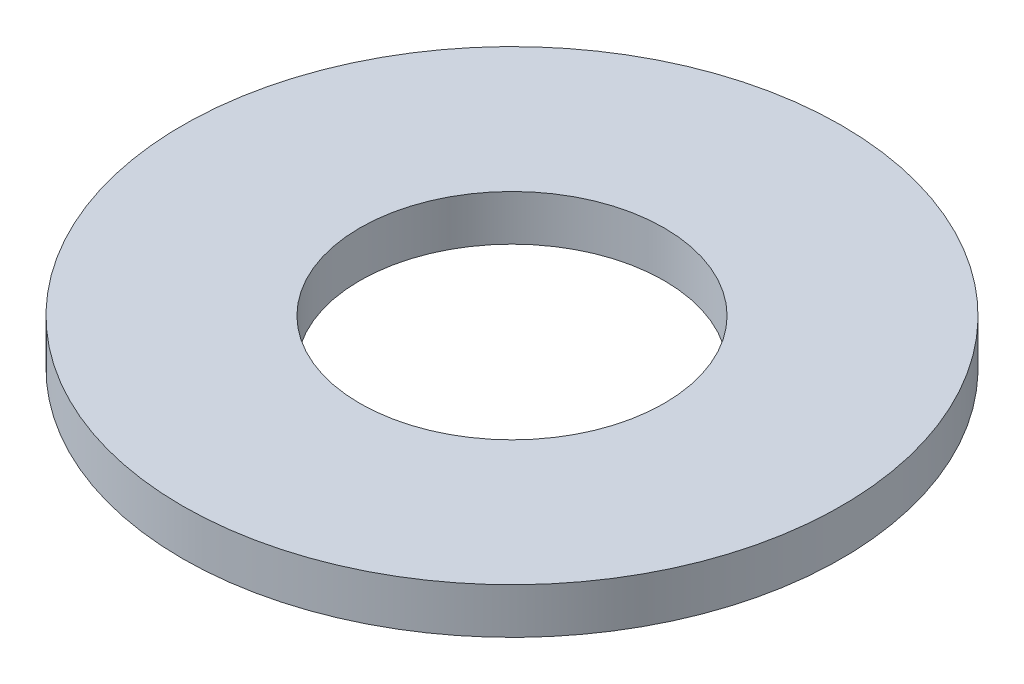
ISO-10303-21;
HEADER;
FILE_DESCRIPTION(('STEP AP214'),'2;1');
FILE_NAME('part.step','',(''),(''),'','','');
FILE_SCHEMA(('AUTOMOTIVE_DESIGN { 1 0 10303 214 1 1 1 1 }'));
ENDSEC;
DATA;
#1=APPLICATION_CONTEXT('core data for automotive mechanical design processes');
#2=APPLICATION_PROTOCOL_DEFINITION('international standard','automotive_design',2000,#1);
#3=PRODUCT_CONTEXT('',#1,'mechanical');
#4=PRODUCT('Part','Part','',(#3));
#5=PRODUCT_RELATED_PRODUCT_CATEGORY('part','',(#4));
#6=PRODUCT_DEFINITION_FORMATION('','',#4);
#7=PRODUCT_DEFINITION_CONTEXT('part definition',#1,'design');
#8=PRODUCT_DEFINITION('design','',#6,#7);
#9=PRODUCT_DEFINITION_SHAPE('','',#8);
#10=(LENGTH_UNIT() NAMED_UNIT(*) SI_UNIT(.MILLI.,.METRE.));
#11=(NAMED_UNIT(*) PLANE_ANGLE_UNIT() SI_UNIT($,.RADIAN.));
#12=(NAMED_UNIT(*) SI_UNIT($,.STERADIAN.) SOLID_ANGLE_UNIT());
#13=UNCERTAINTY_MEASURE_WITH_UNIT(LENGTH_MEASURE(1.E-05),#10,'distance_accuracy_value','');
#14=(GEOMETRIC_REPRESENTATION_CONTEXT(3) GLOBAL_UNCERTAINTY_ASSIGNED_CONTEXT((#13)) GLOBAL_UNIT_ASSIGNED_CONTEXT((#10,
#11,#12)) REPRESENTATION_CONTEXT('',''));
#15=CARTESIAN_POINT('',(0.,0.,0.));
#16=DIRECTION('',(0.,0.,1.));
#17=DIRECTION('',(1.,0.,0.));
#18=AXIS2_PLACEMENT_3D('',#15,#16,#17);
#19=CARTESIAN_POINT('',(0.,9.,0.));
#20=DIRECTION('',(0.,-1.,0.));
#21=DIRECTION('',(0.,0.,-1.));
#22=AXIS2_PLACEMENT_3D('',#19,#20,#21);
#23=CYLINDRICAL_SURFACE('',#22,65.);
#24=CARTESIAN_POINT('',(0.,9.,0.));
#25=DIRECTION('',(0.,1.,0.));
#26=DIRECTION('',(0.,0.,1.));
#27=AXIS2_PLACEMENT_3D('',#24,#25,#26);
#28=CIRCLE('',#27,65.);
#29=CARTESIAN_POINT('',(0.,9.,65.));
#30=VERTEX_POINT('',#29);
#31=EDGE_CURVE('E10',#30,#30,#28,.T.);
#32=ORIENTED_EDGE('',*,*,#31,.F.);
#33=EDGE_LOOP('',(#32));
#34=FACE_BOUND('',#33,.T.);
#35=CARTESIAN_POINT('',(0.,0.,0.));
#36=DIRECTION('',(0.,1.,0.));
#37=DIRECTION('',(0.,0.,1.));
#38=AXIS2_PLACEMENT_3D('',#35,#36,#37);
#39=CIRCLE('',#38,65.);
#40=CARTESIAN_POINT('',(0.,0.,65.));
#41=VERTEX_POINT('',#40);
#42=EDGE_CURVE('E37',#41,#41,#39,.T.);
#43=ORIENTED_EDGE('',*,*,#42,.T.);
#44=EDGE_LOOP('',(#43));
#45=FACE_BOUND('',#44,.T.);
#46=ADVANCED_FACE('F40',(#34,#45),#23,.T.);
#47=CARTESIAN_POINT('',(0.,9.,0.));
#48=DIRECTION('',(0.,1.,0.));
#49=DIRECTION('',(0.,0.,1.));
#50=AXIS2_PLACEMENT_3D('',#47,#48,#49);
#51=PLANE('',#50);
#52=CARTESIAN_POINT('',(0.,9.,0.));
#53=DIRECTION('',(0.,1.,0.));
#54=DIRECTION('',(0.,0.,1.));
#55=AXIS2_PLACEMENT_3D('',#52,#53,#54);
#56=CIRCLE('',#55,30.);
#57=CARTESIAN_POINT('',(0.,9.,30.));
#58=VERTEX_POINT('',#57);
#59=EDGE_CURVE('E50',#58,#58,#56,.T.);
#60=ORIENTED_EDGE('',*,*,#59,.F.);
#61=EDGE_LOOP('',(#60));
#62=FACE_BOUND('',#61,.T.);
#63=ORIENTED_EDGE('',*,*,#31,.T.);
#64=EDGE_LOOP('',(#63));
#65=FACE_BOUND('',#64,.T.);
#66=ADVANCED_FACE('F59',(#62,#65),#51,.T.);
#67=CARTESIAN_POINT('',(0.,0.,0.));
#68=DIRECTION('',(0.,1.,0.));
#69=DIRECTION('',(0.,0.,1.));
#70=AXIS2_PLACEMENT_3D('',#67,#68,#69);
#71=PLANE('',#70);
#72=CARTESIAN_POINT('',(0.,0.,0.));
#73=DIRECTION('',(0.,1.,0.));
#74=DIRECTION('',(0.,0.,1.));
#75=AXIS2_PLACEMENT_3D('',#72,#73,#74);
#76=CIRCLE('',#75,30.);
#77=CARTESIAN_POINT('',(0.,0.,30.));
#78=VERTEX_POINT('',#77);
#79=EDGE_CURVE('E47',#78,#78,#76,.T.);
#80=ORIENTED_EDGE('',*,*,#79,.T.);
#81=EDGE_LOOP('',(#80));
#82=FACE_BOUND('',#81,.T.);
#83=ORIENTED_EDGE('',*,*,#42,.F.);
#84=EDGE_LOOP('',(#83));
#85=FACE_BOUND('',#84,.T.);
#86=ADVANCED_FACE('F58',(#82,#85),#71,.F.);
#87=CARTESIAN_POINT('',(0.,9.,0.));
#88=DIRECTION('',(0.,-1.,0.));
#89=DIRECTION('',(0.,0.,-1.));
#90=AXIS2_PLACEMENT_3D('',#87,#88,#89);
#91=CYLINDRICAL_SURFACE('',#90,30.);
#92=ORIENTED_EDGE('',*,*,#59,.T.);
#93=EDGE_LOOP('',(#92));
#94=FACE_BOUND('',#93,.T.);
#95=ORIENTED_EDGE('',*,*,#79,.F.);
#96=EDGE_LOOP('',(#95));
#97=FACE_BOUND('',#96,.T.);
#98=ADVANCED_FACE('F54',(#94,#97),#91,.F.);
#99=CLOSED_SHELL('',(#46,#66,#86,#98));
#100=MANIFOLD_SOLID_BREP('B2',#99);
#101=ADVANCED_BREP_SHAPE_REPRESENTATION('',(#18,#100),#14);
#102=SHAPE_DEFINITION_REPRESENTATION(#9,#101);
ENDSEC;
END-ISO-10303-21;
